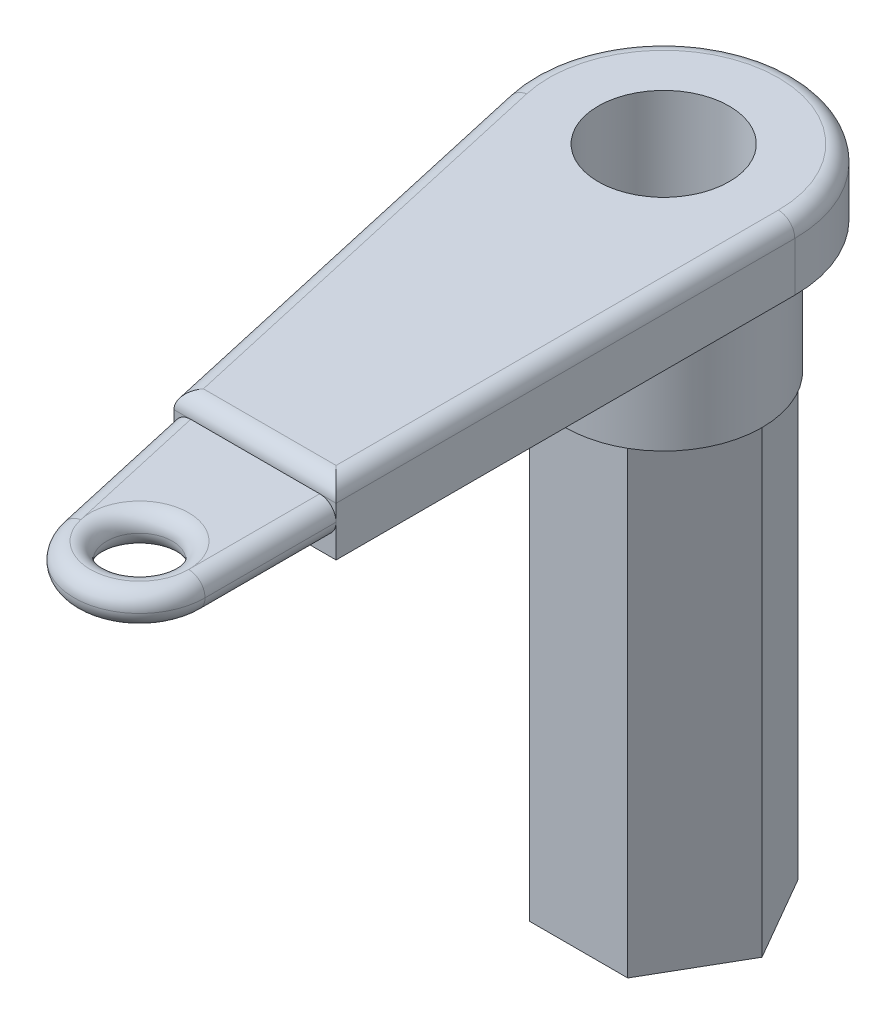
ISO-10303-21;
HEADER;
FILE_DESCRIPTION(('STEP AP214'),'2;1');
FILE_NAME('part.step','',(''),(''),'','','');
FILE_SCHEMA(('AUTOMOTIVE_DESIGN { 1 0 10303 214 1 1 1 1 }'));
ENDSEC;
DATA;
#1=APPLICATION_CONTEXT('core data for automotive mechanical design processes');
#2=APPLICATION_PROTOCOL_DEFINITION('international standard','automotive_design',2000,#1);
#3=PRODUCT_CONTEXT('',#1,'mechanical');
#4=PRODUCT('Part','Part','',(#3));
#5=PRODUCT_RELATED_PRODUCT_CATEGORY('part','',(#4));
#6=PRODUCT_DEFINITION_FORMATION('','',#4);
#7=PRODUCT_DEFINITION_CONTEXT('part definition',#1,'design');
#8=PRODUCT_DEFINITION('design','',#6,#7);
#9=PRODUCT_DEFINITION_SHAPE('','',#8);
#10=(LENGTH_UNIT() NAMED_UNIT(*) SI_UNIT(.MILLI.,.METRE.));
#11=(NAMED_UNIT(*) PLANE_ANGLE_UNIT() SI_UNIT($,.RADIAN.));
#12=(NAMED_UNIT(*) SI_UNIT($,.STERADIAN.) SOLID_ANGLE_UNIT());
#13=UNCERTAINTY_MEASURE_WITH_UNIT(LENGTH_MEASURE(1.E-05),#10,'distance_accuracy_value','');
#14=(GEOMETRIC_REPRESENTATION_CONTEXT(3) GLOBAL_UNCERTAINTY_ASSIGNED_CONTEXT((#13)) GLOBAL_UNIT_ASSIGNED_CONTEXT((#10,
#11,#12)) REPRESENTATION_CONTEXT('',''));
#15=CARTESIAN_POINT('',(0.,0.,0.));
#16=DIRECTION('',(0.,0.,1.));
#17=DIRECTION('',(1.,0.,0.));
#18=AXIS2_PLACEMENT_3D('',#15,#16,#17);
#19=CARTESIAN_POINT('',(-12.,10.,70.));
#20=DIRECTION('',(0.,0.,-1.));
#21=DIRECTION('',(-1.,0.,0.));
#22=AXIS2_PLACEMENT_3D('',#19,#20,#21);
#23=PLANE('',#22);
#24=DIRECTION('',(0.,1.,0.));
#25=VECTOR('',#24,1.);
#26=CARTESIAN_POINT('',(20.,10.,70.));
#27=LINE('',#26,#25);
#28=CARTESIAN_POINT('',(20.,5.,70.));
#29=VERTEX_POINT('',#28);
#30=CARTESIAN_POINT('',(20.,7.5,70.));
#31=VERTEX_POINT('',#30);
#32=EDGE_CURVE('E222',#29,#31,#27,.T.);
#33=ORIENTED_EDGE('',*,*,#32,.T.);
#34=DIRECTION('',(1.,0.,0.));
#35=VECTOR('',#34,1.);
#36=CARTESIAN_POINT('',(-4.74999999999999,7.5,70.));
#37=LINE('',#36,#35);
#38=CARTESIAN_POINT('',(17.5,7.5,70.));
#39=VERTEX_POINT('',#38);
#40=EDGE_CURVE('E64',#31,#39,#37,.F.);
#41=ORIENTED_EDGE('',*,*,#40,.T.);
#42=CARTESIAN_POINT('',(17.5,5.,70.));
#43=DIRECTION('',(0.,0.,-1.));
#44=DIRECTION('',(-1.,0.,0.));
#45=AXIS2_PLACEMENT_3D('',#42,#43,#44);
#46=CIRCLE('',#45,2.5);
#47=EDGE_CURVE('E281',#39,#29,#46,.T.);
#48=ORIENTED_EDGE('',*,*,#47,.T.);
#49=EDGE_LOOP('',(#33,#41,#48));
#50=FACE_BOUND('',#49,.T.);
#51=ADVANCED_FACE('F55',(#50),#23,.F.);
#52=CARTESIAN_POINT('',(0.,-20.,0.));
#53=DIRECTION('',(0.,-1.,0.));
#54=DIRECTION('',(0.,0.,-1.));
#55=AXIS2_PLACEMENT_3D('',#52,#53,#54);
#56=PLANE('',#55);
#57=DIRECTION('',(0.5,0.,0.866025403784439));
#58=VECTOR('',#57,1.);
#59=CARTESIAN_POINT('',(7.5,-20.,-12.9903810567666));
#60=LINE('',#59,#58);
#61=CARTESIAN_POINT('',(7.49999999999998,-20.,-12.9903810567666));
#62=VERTEX_POINT('',#61);
#63=CARTESIAN_POINT('',(15.,-20.,0.));
#64=VERTEX_POINT('',#63);
#65=EDGE_CURVE('E208',#62,#64,#60,.T.);
#66=ORIENTED_EDGE('',*,*,#65,.F.);
#67=CARTESIAN_POINT('',(0.,-20.,0.));
#68=DIRECTION('',(0.,-1.,0.));
#69=DIRECTION('',(0.,0.,-1.));
#70=AXIS2_PLACEMENT_3D('',#67,#68,#69);
#71=CIRCLE('',#70,15.);
#72=EDGE_CURVE('E214',#62,#64,#71,.T.);
#73=ORIENTED_EDGE('',*,*,#72,.T.);
#74=EDGE_LOOP('',(#66,#73));
#75=FACE_BOUND('',#74,.T.);
#76=ADVANCED_FACE('F401',(#75),#56,.T.);
#77=DIRECTION('',(1.,0.,0.));
#78=VECTOR('',#77,1.);
#79=CARTESIAN_POINT('',(-7.50000000000001,-20.,-12.9903810567666));
#80=LINE('',#79,#78);
#81=CARTESIAN_POINT('',(-7.50000000000002,-20.,-12.9903810567666));
#82=VERTEX_POINT('',#81);
#83=EDGE_CURVE('E205',#82,#62,#80,.T.);
#84=ORIENTED_EDGE('',*,*,#83,.F.);
#85=EDGE_CURVE('E209',#82,#62,#71,.T.);
#86=ORIENTED_EDGE('',*,*,#85,.T.);
#87=EDGE_LOOP('',(#84,#86));
#88=FACE_BOUND('',#87,.T.);
#89=ADVANCED_FACE('F403',(#88),#56,.T.);
#90=DIRECTION('',(0.5,0.,-0.866025403784439));
#91=VECTOR('',#90,1.);
#92=CARTESIAN_POINT('',(-15.,-20.,0.));
#93=LINE('',#92,#91);
#94=CARTESIAN_POINT('',(-15.,-20.,0.));
#95=VERTEX_POINT('',#94);
#96=EDGE_CURVE('E366',#95,#82,#93,.T.);
#97=ORIENTED_EDGE('',*,*,#96,.F.);
#98=EDGE_CURVE('E212',#95,#82,#71,.T.);
#99=ORIENTED_EDGE('',*,*,#98,.T.);
#100=EDGE_LOOP('',(#97,#99));
#101=FACE_BOUND('',#100,.T.);
#102=ADVANCED_FACE('F408',(#101),#56,.T.);
#103=DIRECTION('',(-0.5,0.,-0.866025403784439));
#104=VECTOR('',#103,1.);
#105=CARTESIAN_POINT('',(-7.5,-20.,12.9903810567666));
#106=LINE('',#105,#104);
#107=CARTESIAN_POINT('',(-7.49999999999999,-20.,12.9903810567666));
#108=VERTEX_POINT('',#107);
#109=EDGE_CURVE('E363',#108,#95,#106,.T.);
#110=ORIENTED_EDGE('',*,*,#109,.F.);
#111=EDGE_CURVE('E409',#108,#95,#71,.T.);
#112=ORIENTED_EDGE('',*,*,#111,.T.);
#113=EDGE_LOOP('',(#110,#112));
#114=FACE_BOUND('',#113,.T.);
#115=ADVANCED_FACE('F733',(#114),#56,.T.);
#116=DIRECTION('',(-1.,0.,0.));
#117=VECTOR('',#116,1.);
#118=CARTESIAN_POINT('',(7.5,-20.,12.9903810567666));
#119=LINE('',#118,#117);
#120=CARTESIAN_POINT('',(7.5,-20.,12.9903810567666));
#121=VERTEX_POINT('',#120);
#122=EDGE_CURVE('E360',#121,#108,#119,.T.);
#123=ORIENTED_EDGE('',*,*,#122,.F.);
#124=EDGE_CURVE('E390',#121,#108,#71,.T.);
#125=ORIENTED_EDGE('',*,*,#124,.T.);
#126=EDGE_LOOP('',(#123,#125));
#127=FACE_BOUND('',#126,.T.);
#128=ADVANCED_FACE('F388',(#127),#56,.T.);
#129=CARTESIAN_POINT('',(0.,0.,0.));
#130=DIRECTION('',(0.,1.,0.));
#131=DIRECTION('',(0.,0.,1.));
#132=AXIS2_PLACEMENT_3D('',#129,#130,#131);
#133=PLANE('',#132);
#134=DIRECTION('',(0.,0.,-1.));
#135=VECTOR('',#134,1.);
#136=CARTESIAN_POINT('',(20.,0.,0.));
#137=LINE('',#136,#135);
#138=CARTESIAN_POINT('',(20.,0.,70.));
#139=VERTEX_POINT('',#138);
#140=CARTESIAN_POINT('',(20.,0.,0.));
#141=VERTEX_POINT('',#140);
#142=EDGE_CURVE('E251',#139,#141,#137,.T.);
#143=ORIENTED_EDGE('',*,*,#142,.F.);
#144=DIRECTION('',(1.,0.,0.));
#145=VECTOR('',#144,1.);
#146=CARTESIAN_POINT('',(-12.,0.,70.));
#147=LINE('',#146,#145);
#148=CARTESIAN_POINT('',(-4.74999999999999,0.,70.));
#149=VERTEX_POINT('',#148);
#150=EDGE_CURVE('E233',#149,#139,#147,.T.);
#151=ORIENTED_EDGE('',*,*,#150,.F.);
#152=DIRECTION('',(0.219512195121951,0.,0.975609756097561));
#153=VECTOR('',#152,1.);
#154=CARTESIAN_POINT('',(-19.5121951219512,0.,4.39024390243903));
#155=LINE('',#154,#153);
#156=CARTESIAN_POINT('',(-19.5121951219512,0.,4.39024390243903));
#157=VERTEX_POINT('',#156);
#158=EDGE_CURVE('E248',#157,#149,#155,.T.);
#159=ORIENTED_EDGE('',*,*,#158,.F.);
#160=CARTESIAN_POINT('',(0.,0.,0.));
#161=DIRECTION('',(0.,1.,0.));
#162=DIRECTION('',(0.,0.,1.));
#163=AXIS2_PLACEMENT_3D('',#160,#161,#162);
#164=CIRCLE('',#163,20.);
#165=EDGE_CURVE('E245',#141,#157,#164,.T.);
#166=ORIENTED_EDGE('',*,*,#165,.F.);
#167=EDGE_LOOP('',(#143,#151,#159,#166));
#168=FACE_BOUND('',#167,.T.);
#169=CARTESIAN_POINT('',(0.,0.,0.));
#170=DIRECTION('',(0.,1.,0.));
#171=DIRECTION('',(0.,0.,1.));
#172=AXIS2_PLACEMENT_3D('',#169,#170,#171);
#173=CIRCLE('',#172,15.);
#174=CARTESIAN_POINT('',(0.,0.,15.));
#175=VERTEX_POINT('',#174);
#176=EDGE_CURVE('E284',#175,#175,#173,.F.);
#177=ORIENTED_EDGE('',*,*,#176,.F.);
#178=EDGE_LOOP('',(#177));
#179=FACE_BOUND('',#178,.T.);
#180=ADVANCED_FACE('F510',(#168,#179),#133,.F.);
#181=CARTESIAN_POINT('',(0.,10.,0.));
#182=DIRECTION('',(0.,1.,0.));
#183=DIRECTION('',(0.,0.,1.));
#184=AXIS2_PLACEMENT_3D('',#181,#182,#183);
#185=PLANE('',#184);
#186=DIRECTION('',(1.,0.,0.));
#187=VECTOR('',#186,1.);
#188=CARTESIAN_POINT('',(20.,10.,67.5));
#189=LINE('',#188,#187);
#190=CARTESIAN_POINT('',(-2.74999999999999,10.,67.5));
#191=VERTEX_POINT('',#190);
#192=CARTESIAN_POINT('',(17.5,10.,67.5));
#193=VERTEX_POINT('',#192);
#194=EDGE_CURVE('E317',#191,#193,#189,.T.);
#195=ORIENTED_EDGE('',*,*,#194,.T.);
#196=DIRECTION('',(0.,0.,-1.));
#197=VECTOR('',#196,1.);
#198=CARTESIAN_POINT('',(17.5,10.,0.));
#199=LINE('',#198,#197);
#200=CARTESIAN_POINT('',(17.5,10.,0.));
#201=VERTEX_POINT('',#200);
#202=EDGE_CURVE('E321',#193,#201,#199,.T.);
#203=ORIENTED_EDGE('',*,*,#202,.T.);
#204=CARTESIAN_POINT('',(0.,10.,0.));
#205=DIRECTION('',(0.,1.,0.));
#206=DIRECTION('',(0.,0.,1.));
#207=AXIS2_PLACEMENT_3D('',#204,#205,#206);
#208=CIRCLE('',#207,17.5);
#209=CARTESIAN_POINT('',(-17.0731707317073,10.,3.84146341463415));
#210=VERTEX_POINT('',#209);
#211=EDGE_CURVE('E319',#201,#210,#208,.T.);
#212=ORIENTED_EDGE('',*,*,#211,.T.);
#213=DIRECTION('',(0.219512195121951,0.,0.975609756097561));
#214=VECTOR('',#213,1.);
#215=CARTESIAN_POINT('',(-2.31097560975609,10.,69.4512195121951));
#216=LINE('',#215,#214);
#217=EDGE_CURVE('E315',#210,#191,#216,.T.);
#218=ORIENTED_EDGE('',*,*,#217,.T.);
#219=EDGE_LOOP('',(#195,#203,#212,#218));
#220=FACE_BOUND('',#219,.T.);
#221=CARTESIAN_POINT('',(0.,10.,0.));
#222=DIRECTION('',(0.,1.,0.));
#223=DIRECTION('',(0.,0.,1.));
#224=AXIS2_PLACEMENT_3D('',#221,#222,#223);
#225=CIRCLE('',#224,10.);
#226=CARTESIAN_POINT('',(0.,10.,10.));
#227=VERTEX_POINT('',#226);
#228=EDGE_CURVE('E242',#227,#227,#225,.T.);
#229=ORIENTED_EDGE('',*,*,#228,.F.);
#230=EDGE_LOOP('',(#229));
#231=FACE_BOUND('',#230,.T.);
#232=ADVANCED_FACE('F501',(#220,#231),#185,.T.);
#233=CARTESIAN_POINT('',(0.,10.,0.));
#234=DIRECTION('',(0.,-1.,0.));
#235=DIRECTION('',(0.,0.,-1.));
#236=AXIS2_PLACEMENT_3D('',#233,#234,#235);
#237=CYLINDRICAL_SURFACE('',#236,20.);
#238=DIRECTION('',(0.,-1.,0.));
#239=VECTOR('',#238,1.);
#240=CARTESIAN_POINT('',(-19.5121951219512,10.,4.39024390243903));
#241=LINE('',#240,#239);
#242=CARTESIAN_POINT('',(-19.5121951219512,7.5,4.39024390243903));
#243=VERTEX_POINT('',#242);
#244=EDGE_CURVE('E256',#243,#157,#241,.T.);
#245=ORIENTED_EDGE('',*,*,#244,.F.);
#246=CARTESIAN_POINT('',(0.,7.5,0.));
#247=DIRECTION('',(0.,1.,0.));
#248=DIRECTION('',(0.,0.,1.));
#249=AXIS2_PLACEMENT_3D('',#246,#247,#248);
#250=CIRCLE('',#249,20.);
#251=CARTESIAN_POINT('',(20.,7.5,0.));
#252=VERTEX_POINT('',#251);
#253=EDGE_CURVE('E327',#243,#252,#250,.F.);
#254=ORIENTED_EDGE('',*,*,#253,.T.);
#255=DIRECTION('',(0.,-1.,0.));
#256=VECTOR('',#255,1.);
#257=CARTESIAN_POINT('',(20.,10.,0.));
#258=LINE('',#257,#256);
#259=EDGE_CURVE('E254',#252,#141,#258,.T.);
#260=ORIENTED_EDGE('',*,*,#259,.T.);
#261=ORIENTED_EDGE('',*,*,#165,.T.);
#262=EDGE_LOOP('',(#245,#254,#260,#261));
#263=FACE_BOUND('',#262,.T.);
#264=ADVANCED_FACE('F497',(#263),#237,.T.);
#265=CARTESIAN_POINT('',(-19.5121951219512,10.,4.39024390243903));
#266=DIRECTION('',(0.975609756097561,0.,-0.219512195121951));
#267=DIRECTION('',(-0.219512195121951,0.,-0.975609756097561));
#268=AXIS2_PLACEMENT_3D('',#265,#266,#267);
#269=PLANE('',#268);
#270=DIRECTION('',(0.,1.,0.));
#271=VECTOR('',#270,1.);
#272=CARTESIAN_POINT('',(-4.74999999999999,10.,70.));
#273=LINE('',#272,#271);
#274=CARTESIAN_POINT('',(-4.74999999999999,5.,70.));
#275=VERTEX_POINT('',#274);
#276=CARTESIAN_POINT('',(-4.74999999999999,7.5,70.));
#277=VERTEX_POINT('',#276);
#278=EDGE_CURVE('E240',#275,#277,#273,.T.);
#279=ORIENTED_EDGE('',*,*,#278,.T.);
#280=DIRECTION('',(0.219512195121951,0.,0.975609756097561));
#281=VECTOR('',#280,1.);
#282=CARTESIAN_POINT('',(-19.5121951219512,7.5,4.39024390243903));
#283=LINE('',#282,#281);
#284=EDGE_CURVE('E12',#277,#243,#283,.F.);
#285=ORIENTED_EDGE('',*,*,#284,.T.);
#286=ORIENTED_EDGE('',*,*,#244,.T.);
#287=ORIENTED_EDGE('',*,*,#158,.T.);
#288=DIRECTION('',(0.,1.,0.));
#289=VECTOR('',#288,1.);
#290=CARTESIAN_POINT('',(-4.74999999999999,10.,70.));
#291=LINE('',#290,#289);
#292=EDGE_CURVE('E229',#149,#275,#291,.T.);
#293=ORIENTED_EDGE('',*,*,#292,.T.);
#294=EDGE_LOOP('',(#279,#285,#286,#287,#293));
#295=FACE_BOUND('',#294,.T.);
#296=ADVANCED_FACE('F500',(#295),#269,.F.);
#297=CARTESIAN_POINT('',(20.,10.,0.));
#298=DIRECTION('',(-1.,0.,0.));
#299=DIRECTION('',(0.,0.,1.));
#300=AXIS2_PLACEMENT_3D('',#297,#298,#299);
#301=PLANE('',#300);
#302=ORIENTED_EDGE('',*,*,#259,.F.);
#303=DIRECTION('',(0.,0.,-1.));
#304=VECTOR('',#303,1.);
#305=CARTESIAN_POINT('',(20.,7.5,70.));
#306=LINE('',#305,#304);
#307=EDGE_CURVE('E324',#252,#31,#306,.F.);
#308=ORIENTED_EDGE('',*,*,#307,.T.);
#309=ORIENTED_EDGE('',*,*,#32,.F.);
#310=DIRECTION('',(0.,1.,0.));
#311=VECTOR('',#310,1.);
#312=CARTESIAN_POINT('',(20.,0.,70.));
#313=LINE('',#312,#311);
#314=EDGE_CURVE('E230',#139,#29,#313,.T.);
#315=ORIENTED_EDGE('',*,*,#314,.F.);
#316=ORIENTED_EDGE('',*,*,#142,.T.);
#317=EDGE_LOOP('',(#302,#308,#309,#315,#316));
#318=FACE_BOUND('',#317,.T.);
#319=ADVANCED_FACE('F505',(#318),#301,.F.);
#320=CARTESIAN_POINT('',(0.,10.,0.));
#321=DIRECTION('',(0.,-1.,0.));
#322=DIRECTION('',(0.,0.,-1.));
#323=AXIS2_PLACEMENT_3D('',#320,#321,#322);
#324=CYLINDRICAL_SURFACE('',#323,10.);
#325=ORIENTED_EDGE('',*,*,#228,.T.);
#326=EDGE_LOOP('',(#325));
#327=FACE_BOUND('',#326,.T.);
#328=CARTESIAN_POINT('',(0.,-90.,0.));
#329=DIRECTION('',(0.,-1.,0.));
#330=DIRECTION('',(0.,0.,-1.));
#331=AXIS2_PLACEMENT_3D('',#328,#329,#330);
#332=CIRCLE('',#331,10.);
#333=CARTESIAN_POINT('',(0.,-90.,-10.));
#334=VERTEX_POINT('',#333);
#335=EDGE_CURVE('E341',#334,#334,#332,.T.);
#336=ORIENTED_EDGE('',*,*,#335,.T.);
#337=EDGE_LOOP('',(#336));
#338=FACE_BOUND('',#337,.T.);
#339=ADVANCED_FACE('F508',(#327,#338),#324,.F.);
#340=CARTESIAN_POINT('',(-12.,0.,70.));
#341=DIRECTION('',(0.,0.,-1.));
#342=DIRECTION('',(-1.,0.,0.));
#343=AXIS2_PLACEMENT_3D('',#340,#341,#342);
#344=PLANE('',#343);
#345=ORIENTED_EDGE('',*,*,#150,.T.);
#346=ORIENTED_EDGE('',*,*,#314,.T.);
#347=CARTESIAN_POINT('',(17.5,5.,70.));
#348=DIRECTION('',(0.,0.,-1.));
#349=DIRECTION('',(-1.,0.,0.));
#350=AXIS2_PLACEMENT_3D('',#347,#348,#349);
#351=CIRCLE('',#350,2.5);
#352=CARTESIAN_POINT('',(17.5,2.5,70.));
#353=VERTEX_POINT('',#352);
#354=EDGE_CURVE('E277',#29,#353,#351,.T.);
#355=ORIENTED_EDGE('',*,*,#354,.T.);
#356=DIRECTION('',(1.,0.,0.));
#357=VECTOR('',#356,1.);
#358=CARTESIAN_POINT('',(-12.,2.5,70.));
#359=LINE('',#358,#357);
#360=CARTESIAN_POINT('',(-2.18749999999999,2.5,70.));
#361=VERTEX_POINT('',#360);
#362=EDGE_CURVE('E226',#361,#353,#359,.T.);
#363=ORIENTED_EDGE('',*,*,#362,.F.);
#364=CARTESIAN_POINT('',(-2.18749999999999,5.,70.));
#365=DIRECTION('',(0.,0.,-1.));
#366=DIRECTION('',(1.,0.,0.));
#367=AXIS2_PLACEMENT_3D('',#364,#365,#366);
#368=ELLIPSE('',#367,2.5625,2.5);
#369=EDGE_CURVE('E274',#361,#275,#368,.T.);
#370=ORIENTED_EDGE('',*,*,#369,.T.);
#371=ORIENTED_EDGE('',*,*,#292,.F.);
#372=EDGE_LOOP('',(#345,#346,#355,#363,#370,#371));
#373=FACE_BOUND('',#372,.T.);
#374=ADVANCED_FACE('F445',(#373),#344,.F.);
#375=CARTESIAN_POINT('',(-12.,2.5,100.));
#376=DIRECTION('',(0.,1.,0.));
#377=DIRECTION('',(0.,0.,1.));
#378=AXIS2_PLACEMENT_3D('',#375,#376,#377);
#379=PLANE('',#378);
#380=CARTESIAN_POINT('',(10.,2.5,90.));
#381=DIRECTION('',(0.,1.,0.));
#382=DIRECTION('',(0.,0.,1.));
#383=AXIS2_PLACEMENT_3D('',#380,#381,#382);
#384=CIRCLE('',#383,7.5);
#385=CARTESIAN_POINT('',(17.5,2.5,90.));
#386=VERTEX_POINT('',#385);
#387=CARTESIAN_POINT('',(2.68292682926831,2.5,91.6463414634146));
#388=VERTEX_POINT('',#387);
#389=EDGE_CURVE('E258',#386,#388,#384,.T.);
#390=ORIENTED_EDGE('',*,*,#389,.T.);
#391=DIRECTION('',(0.219512195121951,0.,0.975609756097561));
#392=VECTOR('',#391,1.);
#393=CARTESIAN_POINT('',(3.76442593694231,2.5,96.453004164188));
#394=LINE('',#393,#392);
#395=EDGE_CURVE('E262',#388,#361,#394,.F.);
#396=ORIENTED_EDGE('',*,*,#395,.T.);
#397=ORIENTED_EDGE('',*,*,#362,.T.);
#398=DIRECTION('',(0.,0.,1.));
#399=VECTOR('',#398,1.);
#400=CARTESIAN_POINT('',(17.5,2.5,100.));
#401=LINE('',#400,#399);
#402=EDGE_CURVE('E260',#353,#386,#401,.T.);
#403=ORIENTED_EDGE('',*,*,#402,.T.);
#404=EDGE_LOOP('',(#390,#396,#397,#403));
#405=FACE_BOUND('',#404,.T.);
#406=ADVANCED_FACE('F438',(#405),#379,.F.);
#407=CARTESIAN_POINT('',(-2.18749999999999,5.,70.));
#408=DIRECTION('',(0.,0.,-1.));
#409=DIRECTION('',(-1.,0.,0.));
#410=AXIS2_PLACEMENT_3D('',#407,#408,#409);
#411=ELLIPSE('',#410,2.5625,2.5);
#412=CARTESIAN_POINT('',(-2.18749999999999,7.5,70.));
#413=VERTEX_POINT('',#412);
#414=EDGE_CURVE('E279',#275,#413,#411,.T.);
#415=ORIENTED_EDGE('',*,*,#414,.T.);
#416=DIRECTION('',(1.,0.,0.));
#417=VECTOR('',#416,1.);
#418=CARTESIAN_POINT('',(-4.74999999999999,7.5,70.));
#419=LINE('',#418,#417);
#420=EDGE_CURVE('E72',#413,#277,#419,.F.);
#421=ORIENTED_EDGE('',*,*,#420,.T.);
#422=ORIENTED_EDGE('',*,*,#278,.F.);
#423=EDGE_LOOP('',(#415,#421,#422));
#424=FACE_BOUND('',#423,.T.);
#425=ADVANCED_FACE('F429',(#424),#23,.F.);
#426=CARTESIAN_POINT('',(-12.,7.5,100.));
#427=DIRECTION('',(0.,-1.,0.));
#428=DIRECTION('',(0.,0.,-1.));
#429=AXIS2_PLACEMENT_3D('',#426,#427,#428);
#430=PLANE('',#429);
#431=DIRECTION('',(1.,0.,0.));
#432=VECTOR('',#431,1.);
#433=CARTESIAN_POINT('',(-12.,7.5,70.));
#434=LINE('',#433,#432);
#435=EDGE_CURVE('E225',#413,#39,#434,.T.);
#436=ORIENTED_EDGE('',*,*,#435,.F.);
#437=DIRECTION('',(-0.219512195121951,0.,-0.975609756097561));
#438=VECTOR('',#437,1.);
#439=CARTESIAN_POINT('',(3.76442593694231,7.5,96.453004164188));
#440=LINE('',#439,#438);
#441=CARTESIAN_POINT('',(2.6829268292683,7.5,91.6463414634146));
#442=VERTEX_POINT('',#441);
#443=EDGE_CURVE('E272',#413,#442,#440,.F.);
#444=ORIENTED_EDGE('',*,*,#443,.T.);
#445=CARTESIAN_POINT('',(10.,7.5,90.));
#446=DIRECTION('',(0.,-1.,0.));
#447=DIRECTION('',(0.,0.,-1.));
#448=AXIS2_PLACEMENT_3D('',#445,#446,#447);
#449=CIRCLE('',#448,7.5);
#450=CARTESIAN_POINT('',(10.,7.5,82.5));
#451=VERTEX_POINT('',#450);
#452=EDGE_CURVE('E265',#442,#451,#449,.T.);
#453=ORIENTED_EDGE('',*,*,#452,.T.);
#454=CARTESIAN_POINT('',(10.,7.5,90.));
#455=DIRECTION('',(0.,-1.,0.));
#456=DIRECTION('',(0.,0.,-1.));
#457=AXIS2_PLACEMENT_3D('',#454,#455,#456);
#458=CIRCLE('',#457,7.5);
#459=CARTESIAN_POINT('',(17.5,7.5,90.));
#460=VERTEX_POINT('',#459);
#461=EDGE_CURVE('E267',#451,#460,#458,.T.);
#462=ORIENTED_EDGE('',*,*,#461,.T.);
#463=DIRECTION('',(0.,0.,-1.));
#464=VECTOR('',#463,1.);
#465=CARTESIAN_POINT('',(17.5,7.5,100.));
#466=LINE('',#465,#464);
#467=EDGE_CURVE('E269',#460,#39,#466,.T.);
#468=ORIENTED_EDGE('',*,*,#467,.T.);
#469=EDGE_LOOP('',(#436,#444,#453,#462,#468));
#470=FACE_BOUND('',#469,.T.);
#471=ADVANCED_FACE('F437',(#470),#430,.F.);
#472=CARTESIAN_POINT('',(17.5,5.,100.));
#473=DIRECTION('',(0.,0.,-1.));
#474=DIRECTION('',(-1.,0.,0.));
#475=AXIS2_PLACEMENT_3D('',#472,#473,#474);
#476=CYLINDRICAL_SURFACE('',#475,2.5);
#477=ORIENTED_EDGE('',*,*,#47,.F.);
#478=ORIENTED_EDGE('',*,*,#467,.F.);
#479=CARTESIAN_POINT('',(17.5,5.,90.));
#480=DIRECTION('',(0.,0.,1.));
#481=DIRECTION('',(1.,0.,0.));
#482=AXIS2_PLACEMENT_3D('',#479,#480,#481);
#483=CIRCLE('',#482,2.5);
#484=CARTESIAN_POINT('',(20.,5.,90.));
#485=VERTEX_POINT('',#484);
#486=EDGE_CURVE('E308',#485,#460,#483,.T.);
#487=ORIENTED_EDGE('',*,*,#486,.F.);
#488=DIRECTION('',(0.,0.,-1.));
#489=VECTOR('',#488,1.);
#490=CARTESIAN_POINT('',(20.,5.,0.));
#491=LINE('',#490,#489);
#492=EDGE_CURVE('E305',#29,#485,#491,.F.);
#493=ORIENTED_EDGE('',*,*,#492,.F.);
#494=EDGE_LOOP('',(#477,#478,#487,#493));
#495=FACE_BOUND('',#494,.T.);
#496=ADVANCED_FACE('F443',(#495),#476,.T.);
#497=CARTESIAN_POINT('',(10.,5.,90.));
#498=DIRECTION('',(0.,-1.,0.));
#499=DIRECTION('',(0.,0.,-1.));
#500=AXIS2_PLACEMENT_3D('',#497,#498,#499);
#501=TOROIDAL_SURFACE('',#500,7.5,2.5);
#502=CARTESIAN_POINT('',(10.,7.5,90.));
#503=DIRECTION('',(0.,-1.,0.));
#504=DIRECTION('',(0.,0.,-1.));
#505=AXIS2_PLACEMENT_3D('',#502,#503,#504);
#506=CIRCLE('',#505,7.5);
#507=EDGE_CURVE('E234',#460,#442,#506,.T.);
#508=ORIENTED_EDGE('',*,*,#507,.F.);
#509=ORIENTED_EDGE('',*,*,#461,.F.);
#510=ORIENTED_EDGE('',*,*,#452,.F.);
#511=EDGE_LOOP('',(#508,#509,#510));
#512=FACE_BOUND('',#511,.T.);
#513=CARTESIAN_POINT('',(10.,5.,90.));
#514=DIRECTION('',(0.,-1.,0.));
#515=DIRECTION('',(0.,0.,-1.));
#516=AXIS2_PLACEMENT_3D('',#513,#514,#515);
#517=CIRCLE('',#516,5.);
#518=CARTESIAN_POINT('',(10.,5.,85.));
#519=VERTEX_POINT('',#518);
#520=EDGE_CURVE('E302',#519,#519,#517,.F.);
#521=ORIENTED_EDGE('',*,*,#520,.F.);
#522=EDGE_LOOP('',(#521));
#523=FACE_BOUND('',#522,.T.);
#524=ADVANCED_FACE('F470',(#512,#523),#501,.T.);
#525=CARTESIAN_POINT('',(10.,5.,90.));
#526=DIRECTION('',(0.,-1.,0.));
#527=DIRECTION('',(0.,0.,-1.));
#528=AXIS2_PLACEMENT_3D('',#525,#526,#527);
#529=TOROIDAL_SURFACE('',#528,7.5,2.5);
#530=ORIENTED_EDGE('',*,*,#486,.T.);
#531=ORIENTED_EDGE('',*,*,#507,.T.);
#532=CARTESIAN_POINT('',(2.68292682926831,5.,91.6463414634146));
#533=DIRECTION('',(-0.219512195121951,0.,-0.975609756097561));
#534=DIRECTION('',(-0.975609756097561,0.,0.219512195121951));
#535=AXIS2_PLACEMENT_3D('',#532,#533,#534);
#536=CIRCLE('',#535,2.5);
#537=CARTESIAN_POINT('',(0.243902439024404,5.,92.1951219512195));
#538=VERTEX_POINT('',#537);
#539=EDGE_CURVE('E299',#538,#442,#536,.T.);
#540=ORIENTED_EDGE('',*,*,#539,.F.);
#541=CARTESIAN_POINT('',(10.,5.,90.));
#542=DIRECTION('',(0.,-1.,0.));
#543=DIRECTION('',(0.,0.,-1.));
#544=AXIS2_PLACEMENT_3D('',#541,#542,#543);
#545=CIRCLE('',#544,10.);
#546=EDGE_CURVE('E296',#485,#538,#545,.T.);
#547=ORIENTED_EDGE('',*,*,#546,.F.);
#548=EDGE_LOOP('',(#530,#531,#540,#547));
#549=FACE_BOUND('',#548,.T.);
#550=ADVANCED_FACE('F474',(#549),#529,.T.);
#551=CARTESIAN_POINT('',(17.5,5.,100.));
#552=DIRECTION('',(0.,0.,1.));
#553=DIRECTION('',(1.,0.,0.));
#554=AXIS2_PLACEMENT_3D('',#551,#552,#553);
#555=CYLINDRICAL_SURFACE('',#554,2.5);
#556=ORIENTED_EDGE('',*,*,#354,.F.);
#557=ORIENTED_EDGE('',*,*,#492,.T.);
#558=CARTESIAN_POINT('',(17.5,5.,90.));
#559=DIRECTION('',(0.,0.,1.));
#560=DIRECTION('',(1.,0.,0.));
#561=AXIS2_PLACEMENT_3D('',#558,#559,#560);
#562=CIRCLE('',#561,2.5);
#563=EDGE_CURVE('E293',#386,#485,#562,.T.);
#564=ORIENTED_EDGE('',*,*,#563,.F.);
#565=ORIENTED_EDGE('',*,*,#402,.F.);
#566=EDGE_LOOP('',(#556,#557,#564,#565));
#567=FACE_BOUND('',#566,.T.);
#568=ADVANCED_FACE('F478',(#567),#555,.T.);
#569=CARTESIAN_POINT('',(10.,5.,90.));
#570=DIRECTION('',(0.,1.,0.));
#571=DIRECTION('',(0.,0.,1.));
#572=AXIS2_PLACEMENT_3D('',#569,#570,#571);
#573=TOROIDAL_SURFACE('',#572,7.5,2.5);
#574=ORIENTED_EDGE('',*,*,#520,.T.);
#575=EDGE_LOOP('',(#574));
#576=FACE_BOUND('',#575,.T.);
#577=CARTESIAN_POINT('',(10.,2.5,90.));
#578=DIRECTION('',(0.,1.,0.));
#579=DIRECTION('',(0.,0.,1.));
#580=AXIS2_PLACEMENT_3D('',#577,#578,#579);
#581=CIRCLE('',#580,7.5);
#582=EDGE_CURVE('E290',#388,#386,#581,.T.);
#583=ORIENTED_EDGE('',*,*,#582,.F.);
#584=ORIENTED_EDGE('',*,*,#389,.F.);
#585=EDGE_LOOP('',(#583,#584));
#586=FACE_BOUND('',#585,.T.);
#587=ADVANCED_FACE('F482',(#576,#586),#573,.T.);
#588=CARTESIAN_POINT('',(-17.0731707317073,5.,3.84146341463415));
#589=DIRECTION('',(-0.219512195121951,0.,-0.975609756097561));
#590=DIRECTION('',(-0.975609756097561,0.,0.219512195121951));
#591=AXIS2_PLACEMENT_3D('',#588,#589,#590);
#592=CYLINDRICAL_SURFACE('',#591,2.5);
#593=ORIENTED_EDGE('',*,*,#443,.F.);
#594=ORIENTED_EDGE('',*,*,#414,.F.);
#595=DIRECTION('',(-0.219512195121951,0.,-0.975609756097561));
#596=VECTOR('',#595,1.);
#597=CARTESIAN_POINT('',(-19.5121951219512,5.,4.39024390243903));
#598=LINE('',#597,#596);
#599=EDGE_CURVE('E287',#538,#275,#598,.T.);
#600=ORIENTED_EDGE('',*,*,#599,.F.);
#601=ORIENTED_EDGE('',*,*,#539,.T.);
#602=EDGE_LOOP('',(#593,#594,#600,#601));
#603=FACE_BOUND('',#602,.T.);
#604=ADVANCED_FACE('F456',(#603),#592,.T.);
#605=CARTESIAN_POINT('',(10.,5.,90.));
#606=DIRECTION('',(0.,1.,0.));
#607=DIRECTION('',(0.,0.,1.));
#608=AXIS2_PLACEMENT_3D('',#605,#606,#607);
#609=TOROIDAL_SURFACE('',#608,7.5,2.5);
#610=ORIENTED_EDGE('',*,*,#563,.T.);
#611=ORIENTED_EDGE('',*,*,#546,.T.);
#612=CARTESIAN_POINT('',(2.68292682926831,5.,91.6463414634146));
#613=DIRECTION('',(-0.219512195121951,0.,-0.975609756097561));
#614=DIRECTION('',(-0.975609756097561,0.,0.219512195121951));
#615=AXIS2_PLACEMENT_3D('',#612,#613,#614);
#616=CIRCLE('',#615,2.5);
#617=EDGE_CURVE('E220',#388,#538,#616,.T.);
#618=ORIENTED_EDGE('',*,*,#617,.F.);
#619=ORIENTED_EDGE('',*,*,#582,.T.);
#620=EDGE_LOOP('',(#610,#611,#618,#619));
#621=FACE_BOUND('',#620,.T.);
#622=ADVANCED_FACE('F489',(#621),#609,.T.);
#623=CARTESIAN_POINT('',(-17.0731707317073,5.,3.84146341463415));
#624=DIRECTION('',(0.219512195121951,0.,0.975609756097561));
#625=DIRECTION('',(0.975609756097561,0.,-0.219512195121951));
#626=AXIS2_PLACEMENT_3D('',#623,#624,#625);
#627=CYLINDRICAL_SURFACE('',#626,2.5);
#628=ORIENTED_EDGE('',*,*,#369,.F.);
#629=ORIENTED_EDGE('',*,*,#395,.F.);
#630=ORIENTED_EDGE('',*,*,#617,.T.);
#631=ORIENTED_EDGE('',*,*,#599,.T.);
#632=EDGE_LOOP('',(#628,#629,#630,#631));
#633=FACE_BOUND('',#632,.T.);
#634=ADVANCED_FACE('F492',(#633),#627,.T.);
#635=DIRECTION('',(-0.5,0.,0.866025403784439));
#636=VECTOR('',#635,1.);
#637=CARTESIAN_POINT('',(15.,-20.,0.));
#638=LINE('',#637,#636);
#639=EDGE_CURVE('E349',#64,#121,#638,.T.);
#640=ORIENTED_EDGE('',*,*,#639,.F.);
#641=EDGE_CURVE('E221',#64,#121,#71,.T.);
#642=ORIENTED_EDGE('',*,*,#641,.T.);
#643=EDGE_LOOP('',(#640,#642));
#644=FACE_BOUND('',#643,.T.);
#645=ADVANCED_FACE('F393',(#644),#56,.T.);
#646=CARTESIAN_POINT('',(0.,-20.,0.));
#647=DIRECTION('',(0.,1.,0.));
#648=DIRECTION('',(0.,0.,1.));
#649=AXIS2_PLACEMENT_3D('',#646,#647,#648);
#650=CYLINDRICAL_SURFACE('',#649,15.);
#651=ORIENTED_EDGE('',*,*,#72,.F.);
#652=ORIENTED_EDGE('',*,*,#85,.F.);
#653=ORIENTED_EDGE('',*,*,#98,.F.);
#654=ORIENTED_EDGE('',*,*,#111,.F.);
#655=ORIENTED_EDGE('',*,*,#124,.F.);
#656=ORIENTED_EDGE('',*,*,#641,.F.);
#657=EDGE_LOOP('',(#651,#652,#653,#654,#655,#656));
#658=FACE_BOUND('',#657,.T.);
#659=ORIENTED_EDGE('',*,*,#176,.T.);
#660=EDGE_LOOP('',(#659));
#661=FACE_BOUND('',#660,.T.);
#662=ADVANCED_FACE('F396',(#658,#661),#650,.T.);
#663=CARTESIAN_POINT('',(0.,-90.,0.));
#664=DIRECTION('',(0.,-1.,0.));
#665=DIRECTION('',(0.,0.,-1.));
#666=AXIS2_PLACEMENT_3D('',#663,#664,#665);
#667=PLANE('',#666);
#668=DIRECTION('',(0.5,0.,0.866025403784439));
#669=VECTOR('',#668,1.);
#670=CARTESIAN_POINT('',(7.5,-90.,-12.9903810567666));
#671=LINE('',#670,#669);
#672=CARTESIAN_POINT('',(7.5,-90.,-12.9903810567666));
#673=VERTEX_POINT('',#672);
#674=CARTESIAN_POINT('',(15.,-90.,0.));
#675=VERTEX_POINT('',#674);
#676=EDGE_CURVE('E195',#673,#675,#671,.T.);
#677=ORIENTED_EDGE('',*,*,#676,.T.);
#678=DIRECTION('',(-0.5,0.,0.866025403784439));
#679=VECTOR('',#678,1.);
#680=CARTESIAN_POINT('',(15.,-90.,0.));
#681=LINE('',#680,#679);
#682=CARTESIAN_POINT('',(7.5,-90.,12.9903810567666));
#683=VERTEX_POINT('',#682);
#684=EDGE_CURVE('E183',#675,#683,#681,.T.);
#685=ORIENTED_EDGE('',*,*,#684,.T.);
#686=DIRECTION('',(-1.,0.,0.));
#687=VECTOR('',#686,1.);
#688=CARTESIAN_POINT('',(7.5,-90.,12.9903810567666));
#689=LINE('',#688,#687);
#690=CARTESIAN_POINT('',(-7.5,-90.,12.9903810567666));
#691=VERTEX_POINT('',#690);
#692=EDGE_CURVE('E194',#683,#691,#689,.T.);
#693=ORIENTED_EDGE('',*,*,#692,.T.);
#694=DIRECTION('',(-0.5,0.,-0.866025403784439));
#695=VECTOR('',#694,1.);
#696=CARTESIAN_POINT('',(-7.5,-90.,12.9903810567666));
#697=LINE('',#696,#695);
#698=CARTESIAN_POINT('',(-15.,-90.,0.));
#699=VERTEX_POINT('',#698);
#700=EDGE_CURVE('E353',#691,#699,#697,.T.);
#701=ORIENTED_EDGE('',*,*,#700,.T.);
#702=DIRECTION('',(0.5,0.,-0.866025403784439));
#703=VECTOR('',#702,1.);
#704=CARTESIAN_POINT('',(-15.,-90.,0.));
#705=LINE('',#704,#703);
#706=CARTESIAN_POINT('',(-7.50000000000001,-90.,-12.9903810567666));
#707=VERTEX_POINT('',#706);
#708=EDGE_CURVE('E355',#699,#707,#705,.T.);
#709=ORIENTED_EDGE('',*,*,#708,.T.);
#710=DIRECTION('',(1.,0.,0.));
#711=VECTOR('',#710,1.);
#712=CARTESIAN_POINT('',(-7.50000000000001,-90.,-12.9903810567666));
#713=LINE('',#712,#711);
#714=EDGE_CURVE('E201',#707,#673,#713,.T.);
#715=ORIENTED_EDGE('',*,*,#714,.T.);
#716=EDGE_LOOP('',(#677,#685,#693,#701,#709,#715));
#717=FACE_BOUND('',#716,.T.);
#718=ORIENTED_EDGE('',*,*,#335,.F.);
#719=EDGE_LOOP('',(#718));
#720=FACE_BOUND('',#719,.T.);
#721=ADVANCED_FACE('F198',(#717,#720),#667,.T.);
#722=CARTESIAN_POINT('',(7.5,-90.,-12.9903810567666));
#723=DIRECTION('',(-0.866025403784439,0.,0.5));
#724=DIRECTION('',(0.5,0.,0.866025403784439));
#725=AXIS2_PLACEMENT_3D('',#722,#723,#724);
#726=PLANE('',#725);
#727=ORIENTED_EDGE('',*,*,#65,.T.);
#728=DIRECTION('',(0.,1.,0.));
#729=VECTOR('',#728,1.);
#730=CARTESIAN_POINT('',(15.,-90.,0.));
#731=LINE('',#730,#729);
#732=EDGE_CURVE('E188',#675,#64,#731,.T.);
#733=ORIENTED_EDGE('',*,*,#732,.F.);
#734=ORIENTED_EDGE('',*,*,#676,.F.);
#735=DIRECTION('',(0.,1.,0.));
#736=VECTOR('',#735,1.);
#737=CARTESIAN_POINT('',(7.5,-90.,-12.9903810567666));
#738=LINE('',#737,#736);
#739=EDGE_CURVE('E357',#673,#62,#738,.T.);
#740=ORIENTED_EDGE('',*,*,#739,.T.);
#741=EDGE_LOOP('',(#727,#733,#734,#740));
#742=FACE_BOUND('',#741,.T.);
#743=ADVANCED_FACE('F207',(#742),#726,.F.);
#744=CARTESIAN_POINT('',(15.,-90.,0.));
#745=DIRECTION('',(-0.866025403784439,0.,-0.5));
#746=DIRECTION('',(-0.5,0.,0.866025403784439));
#747=AXIS2_PLACEMENT_3D('',#744,#745,#746);
#748=PLANE('',#747);
#749=ORIENTED_EDGE('',*,*,#639,.T.);
#750=DIRECTION('',(0.,1.,0.));
#751=VECTOR('',#750,1.);
#752=CARTESIAN_POINT('',(7.5,-90.,12.9903810567666));
#753=LINE('',#752,#751);
#754=EDGE_CURVE('E191',#683,#121,#753,.T.);
#755=ORIENTED_EDGE('',*,*,#754,.F.);
#756=ORIENTED_EDGE('',*,*,#684,.F.);
#757=ORIENTED_EDGE('',*,*,#732,.T.);
#758=EDGE_LOOP('',(#749,#755,#756,#757));
#759=FACE_BOUND('',#758,.T.);
#760=ADVANCED_FACE('F186',(#759),#748,.F.);
#761=CARTESIAN_POINT('',(7.5,-90.,12.9903810567666));
#762=DIRECTION('',(0.,0.,-1.));
#763=DIRECTION('',(-1.,0.,0.));
#764=AXIS2_PLACEMENT_3D('',#761,#762,#763);
#765=PLANE('',#764);
#766=ORIENTED_EDGE('',*,*,#122,.T.);
#767=DIRECTION('',(0.,1.,0.));
#768=VECTOR('',#767,1.);
#769=CARTESIAN_POINT('',(-7.5,-90.,12.9903810567666));
#770=LINE('',#769,#768);
#771=EDGE_CURVE('E215',#691,#108,#770,.T.);
#772=ORIENTED_EDGE('',*,*,#771,.F.);
#773=ORIENTED_EDGE('',*,*,#692,.F.);
#774=ORIENTED_EDGE('',*,*,#754,.T.);
#775=EDGE_LOOP('',(#766,#772,#773,#774));
#776=FACE_BOUND('',#775,.T.);
#777=ADVANCED_FACE('F384',(#776),#765,.F.);
#778=CARTESIAN_POINT('',(-7.5,-90.,12.9903810567666));
#779=DIRECTION('',(0.866025403784439,0.,-0.5));
#780=DIRECTION('',(-0.5,0.,-0.866025403784439));
#781=AXIS2_PLACEMENT_3D('',#778,#779,#780);
#782=PLANE('',#781);
#783=ORIENTED_EDGE('',*,*,#109,.T.);
#784=DIRECTION('',(0.,1.,0.));
#785=VECTOR('',#784,1.);
#786=CARTESIAN_POINT('',(-15.,-90.,0.));
#787=LINE('',#786,#785);
#788=EDGE_CURVE('E375',#699,#95,#787,.T.);
#789=ORIENTED_EDGE('',*,*,#788,.F.);
#790=ORIENTED_EDGE('',*,*,#700,.F.);
#791=ORIENTED_EDGE('',*,*,#771,.T.);
#792=EDGE_LOOP('',(#783,#789,#790,#791));
#793=FACE_BOUND('',#792,.T.);
#794=ADVANCED_FACE('F381',(#793),#782,.F.);
#795=CARTESIAN_POINT('',(-15.,-90.,0.));
#796=DIRECTION('',(0.866025403784439,0.,0.5));
#797=DIRECTION('',(0.5,0.,-0.866025403784439));
#798=AXIS2_PLACEMENT_3D('',#795,#796,#797);
#799=PLANE('',#798);
#800=ORIENTED_EDGE('',*,*,#96,.T.);
#801=DIRECTION('',(0.,1.,0.));
#802=VECTOR('',#801,1.);
#803=CARTESIAN_POINT('',(-7.50000000000001,-90.,-12.9903810567666));
#804=LINE('',#803,#802);
#805=EDGE_CURVE('E372',#707,#82,#804,.T.);
#806=ORIENTED_EDGE('',*,*,#805,.F.);
#807=ORIENTED_EDGE('',*,*,#708,.F.);
#808=ORIENTED_EDGE('',*,*,#788,.T.);
#809=EDGE_LOOP('',(#800,#806,#807,#808));
#810=FACE_BOUND('',#809,.T.);
#811=ADVANCED_FACE('F412',(#810),#799,.F.);
#812=CARTESIAN_POINT('',(-7.50000000000001,-90.,-12.9903810567666));
#813=DIRECTION('',(0.,0.,1.));
#814=DIRECTION('',(1.,0.,0.));
#815=AXIS2_PLACEMENT_3D('',#812,#813,#814);
#816=PLANE('',#815);
#817=ORIENTED_EDGE('',*,*,#83,.T.);
#818=ORIENTED_EDGE('',*,*,#739,.F.);
#819=ORIENTED_EDGE('',*,*,#714,.F.);
#820=ORIENTED_EDGE('',*,*,#805,.T.);
#821=EDGE_LOOP('',(#817,#818,#819,#820));
#822=FACE_BOUND('',#821,.T.);
#823=ADVANCED_FACE('F415',(#822),#816,.F.);
#824=CARTESIAN_POINT('',(-17.0731707317073,7.5,3.84146341463415));
#825=DIRECTION('',(-0.219512195121951,0.,-0.975609756097561));
#826=DIRECTION('',(-0.975609756097561,0.,0.219512195121951));
#827=AXIS2_PLACEMENT_3D('',#824,#825,#826);
#828=CYLINDRICAL_SURFACE('',#827,2.5);
#829=CARTESIAN_POINT('',(-17.0731707317073,7.5,3.84146341463415));
#830=DIRECTION('',(-0.219512195121952,0.,-0.975609756097561));
#831=DIRECTION('',(-0.975609756097561,0.,0.219512195121952));
#832=AXIS2_PLACEMENT_3D('',#829,#830,#831);
#833=CIRCLE('',#832,2.5);
#834=EDGE_CURVE('E334',#243,#210,#833,.T.);
#835=ORIENTED_EDGE('',*,*,#834,.F.);
#836=ORIENTED_EDGE('',*,*,#284,.F.);
#837=CARTESIAN_POINT('',(-2.74999999999999,7.5,67.5));
#838=DIRECTION('',(-0.78086880944303,0.,-0.624695047554424));
#839=DIRECTION('',(0.624695047554424,0.,-0.78086880944303));
#840=AXIS2_PLACEMENT_3D('',#837,#838,#839);
#841=ELLIPSE('',#840,3.20156211871642,2.5);
#842=EDGE_CURVE('E59',#191,#277,#841,.F.);
#843=ORIENTED_EDGE('',*,*,#842,.F.);
#844=ORIENTED_EDGE('',*,*,#217,.F.);
#845=EDGE_LOOP('',(#835,#836,#843,#844));
#846=FACE_BOUND('',#845,.T.);
#847=ADVANCED_FACE('F57',(#846),#828,.T.);
#848=CARTESIAN_POINT('',(0.,7.5,67.5));
#849=DIRECTION('',(-1.,0.,0.));
#850=DIRECTION('',(0.,0.,1.));
#851=AXIS2_PLACEMENT_3D('',#848,#849,#850);
#852=CYLINDRICAL_SURFACE('',#851,2.5);
#853=ORIENTED_EDGE('',*,*,#435,.T.);
#854=ORIENTED_EDGE('',*,*,#40,.F.);
#855=CARTESIAN_POINT('',(17.5,7.5,67.5));
#856=DIRECTION('',(-0.707106781186547,0.,0.707106781186548));
#857=DIRECTION('',(-0.707106781186548,0.,-0.707106781186547));
#858=AXIS2_PLACEMENT_3D('',#855,#856,#857);
#859=ELLIPSE('',#858,3.53553390593274,2.5);
#860=EDGE_CURVE('E333',#193,#31,#859,.F.);
#861=ORIENTED_EDGE('',*,*,#860,.F.);
#862=ORIENTED_EDGE('',*,*,#194,.F.);
#863=ORIENTED_EDGE('',*,*,#842,.T.);
#864=ORIENTED_EDGE('',*,*,#420,.F.);
#865=EDGE_LOOP('',(#853,#854,#861,#862,#863,#864));
#866=FACE_BOUND('',#865,.T.);
#867=ADVANCED_FACE('F422',(#866),#852,.T.);
#868=CARTESIAN_POINT('',(0.,7.5,0.));
#869=DIRECTION('',(0.,1.,0.));
#870=DIRECTION('',(0.,0.,1.));
#871=AXIS2_PLACEMENT_3D('',#868,#869,#870);
#872=TOROIDAL_SURFACE('',#871,17.5,2.5);
#873=ORIENTED_EDGE('',*,*,#834,.T.);
#874=ORIENTED_EDGE('',*,*,#211,.F.);
#875=CARTESIAN_POINT('',(17.5,7.5,0.));
#876=DIRECTION('',(0.,0.,1.));
#877=DIRECTION('',(1.,0.,0.));
#878=AXIS2_PLACEMENT_3D('',#875,#876,#877);
#879=CIRCLE('',#878,2.5);
#880=EDGE_CURVE('E331',#252,#201,#879,.T.);
#881=ORIENTED_EDGE('',*,*,#880,.F.);
#882=ORIENTED_EDGE('',*,*,#253,.F.);
#883=EDGE_LOOP('',(#873,#874,#881,#882));
#884=FACE_BOUND('',#883,.T.);
#885=ADVANCED_FACE('F458',(#884),#872,.T.);
#886=CARTESIAN_POINT('',(17.5,7.5,0.));
#887=DIRECTION('',(0.,0.,1.));
#888=DIRECTION('',(1.,0.,0.));
#889=AXIS2_PLACEMENT_3D('',#886,#887,#888);
#890=CYLINDRICAL_SURFACE('',#889,2.5);
#891=ORIENTED_EDGE('',*,*,#860,.T.);
#892=ORIENTED_EDGE('',*,*,#307,.F.);
#893=ORIENTED_EDGE('',*,*,#880,.T.);
#894=ORIENTED_EDGE('',*,*,#202,.F.);
#895=EDGE_LOOP('',(#891,#892,#893,#894));
#896=FACE_BOUND('',#895,.T.);
#897=ADVANCED_FACE('F462',(#896),#890,.T.);
#898=CLOSED_SHELL('',(#51,#76,#89,#102,#115,#128,#180,#232,#264,#296,#319,#339,#374,#406,#425,
#471,#496,#524,#550,#568,#587,#604,#622,#634,#645,#662,#721,#743,#760,#777,#794,#811,#823,#847,
#867,#885,#897));
#899=MANIFOLD_SOLID_BREP('B2',#898);
#900=ADVANCED_BREP_SHAPE_REPRESENTATION('',(#18,#899),#14);
#901=SHAPE_DEFINITION_REPRESENTATION(#9,#900);
ENDSEC;
END-ISO-10303-21;
